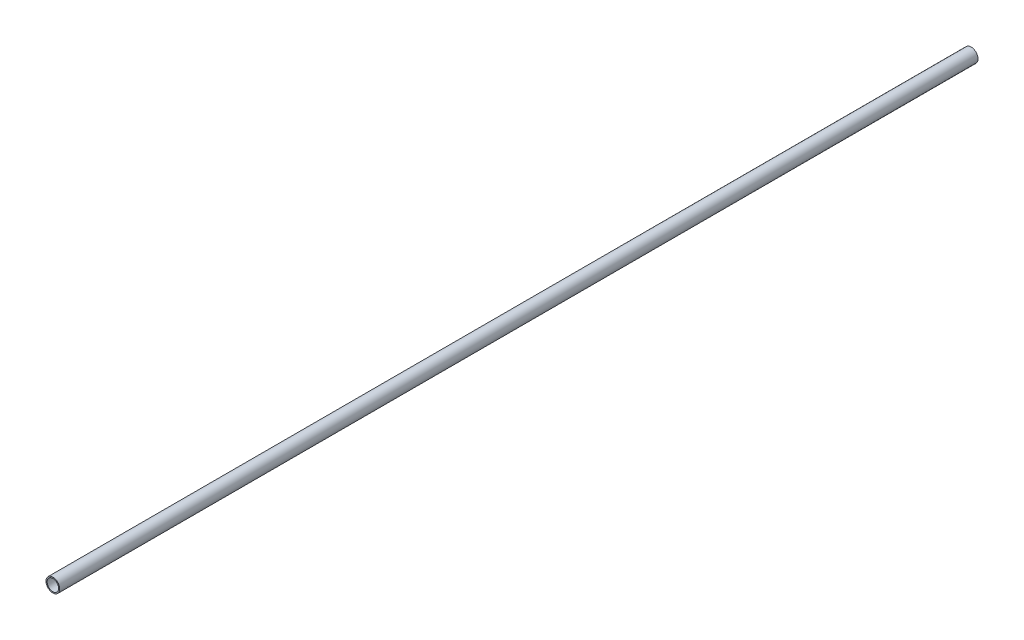
ISO-10303-21;
HEADER;
FILE_DESCRIPTION(('STEP AP214'),'2;1');
FILE_NAME('part.step','',(''),(''),'','','');
FILE_SCHEMA(('AUTOMOTIVE_DESIGN { 1 0 10303 214 1 1 1 1 }'));
ENDSEC;
DATA;
#1=APPLICATION_CONTEXT('core data for automotive mechanical design processes');
#2=APPLICATION_PROTOCOL_DEFINITION('international standard','automotive_design',2000,#1);
#3=PRODUCT_CONTEXT('',#1,'mechanical');
#4=PRODUCT('Part','Part','',(#3));
#5=PRODUCT_RELATED_PRODUCT_CATEGORY('part','',(#4));
#6=PRODUCT_DEFINITION_FORMATION('','',#4);
#7=PRODUCT_DEFINITION_CONTEXT('part definition',#1,'design');
#8=PRODUCT_DEFINITION('design','',#6,#7);
#9=PRODUCT_DEFINITION_SHAPE('','',#8);
#10=(LENGTH_UNIT() NAMED_UNIT(*) SI_UNIT(.MILLI.,.METRE.));
#11=(NAMED_UNIT(*) PLANE_ANGLE_UNIT() SI_UNIT($,.RADIAN.));
#12=(NAMED_UNIT(*) SI_UNIT($,.STERADIAN.) SOLID_ANGLE_UNIT());
#13=UNCERTAINTY_MEASURE_WITH_UNIT(LENGTH_MEASURE(1.E-05),#10,'distance_accuracy_value','');
#14=(GEOMETRIC_REPRESENTATION_CONTEXT(3) GLOBAL_UNCERTAINTY_ASSIGNED_CONTEXT((#13)) GLOBAL_UNIT_ASSIGNED_CONTEXT((#10,
#11,#12)) REPRESENTATION_CONTEXT('',''));
#15=CARTESIAN_POINT('',(0.,0.,0.));
#16=DIRECTION('',(0.,0.,1.));
#17=DIRECTION('',(1.,0.,0.));
#18=AXIS2_PLACEMENT_3D('',#15,#16,#17);
#19=CARTESIAN_POINT('',(0.,0.,800.));
#20=DIRECTION('',(0.,0.,1.));
#21=DIRECTION('',(1.,0.,0.));
#22=AXIS2_PLACEMENT_3D('',#19,#20,#21);
#23=PLANE('',#22);
#24=CARTESIAN_POINT('',(0.,0.,800.));
#25=DIRECTION('',(0.,0.,1.));
#26=DIRECTION('',(1.,0.,0.));
#27=AXIS2_PLACEMENT_3D('',#24,#25,#26);
#28=CIRCLE('',#27,6.);
#29=CARTESIAN_POINT('',(6.,0.,800.));
#30=VERTEX_POINT('',#29);
#31=EDGE_CURVE('E10',#30,#30,#28,.T.);
#32=ORIENTED_EDGE('',*,*,#31,.T.);
#33=EDGE_LOOP('',(#32));
#34=FACE_BOUND('',#33,.T.);
#35=CARTESIAN_POINT('',(0.,0.,800.));
#36=DIRECTION('',(0.,0.,1.));
#37=DIRECTION('',(1.,0.,0.));
#38=AXIS2_PLACEMENT_3D('',#35,#36,#37);
#39=CIRCLE('',#38,5.);
#40=CARTESIAN_POINT('',(5.,0.,800.));
#41=VERTEX_POINT('',#40);
#42=EDGE_CURVE('E41',#41,#41,#39,.T.);
#43=ORIENTED_EDGE('',*,*,#42,.F.);
#44=EDGE_LOOP('',(#43));
#45=FACE_BOUND('',#44,.T.);
#46=ADVANCED_FACE('F30',(#34,#45),#23,.T.);
#47=CARTESIAN_POINT('',(0.,0.,0.));
#48=DIRECTION('',(0.,0.,1.));
#49=DIRECTION('',(1.,0.,0.));
#50=AXIS2_PLACEMENT_3D('',#47,#48,#49);
#51=PLANE('',#50);
#52=CARTESIAN_POINT('',(0.,0.,0.));
#53=DIRECTION('',(0.,0.,1.));
#54=DIRECTION('',(1.,0.,0.));
#55=AXIS2_PLACEMENT_3D('',#52,#53,#54);
#56=CIRCLE('',#55,6.);
#57=CARTESIAN_POINT('',(6.,0.,0.));
#58=VERTEX_POINT('',#57);
#59=EDGE_CURVE('E34',#58,#58,#56,.T.);
#60=ORIENTED_EDGE('',*,*,#59,.F.);
#61=EDGE_LOOP('',(#60));
#62=FACE_BOUND('',#61,.T.);
#63=CARTESIAN_POINT('',(0.,0.,0.));
#64=DIRECTION('',(0.,0.,1.));
#65=DIRECTION('',(1.,0.,0.));
#66=AXIS2_PLACEMENT_3D('',#63,#64,#65);
#67=CIRCLE('',#66,5.);
#68=CARTESIAN_POINT('',(5.,0.,0.));
#69=VERTEX_POINT('',#68);
#70=EDGE_CURVE('E43',#69,#69,#67,.T.);
#71=ORIENTED_EDGE('',*,*,#70,.T.);
#72=EDGE_LOOP('',(#71));
#73=FACE_BOUND('',#72,.T.);
#74=ADVANCED_FACE('F53',(#62,#73),#51,.F.);
#75=CARTESIAN_POINT('',(0.,0.,800.));
#76=DIRECTION('',(0.,0.,-1.));
#77=DIRECTION('',(-1.,0.,0.));
#78=AXIS2_PLACEMENT_3D('',#75,#76,#77);
#79=CYLINDRICAL_SURFACE('',#78,6.);
#80=ORIENTED_EDGE('',*,*,#31,.F.);
#81=EDGE_LOOP('',(#80));
#82=FACE_BOUND('',#81,.T.);
#83=ORIENTED_EDGE('',*,*,#59,.T.);
#84=EDGE_LOOP('',(#83));
#85=FACE_BOUND('',#84,.T.);
#86=ADVANCED_FACE('F32',(#82,#85),#79,.T.);
#87=CARTESIAN_POINT('',(0.,0.,800.));
#88=DIRECTION('',(0.,0.,-1.));
#89=DIRECTION('',(-1.,0.,0.));
#90=AXIS2_PLACEMENT_3D('',#87,#88,#89);
#91=CYLINDRICAL_SURFACE('',#90,5.);
#92=ORIENTED_EDGE('',*,*,#42,.T.);
#93=EDGE_LOOP('',(#92));
#94=FACE_BOUND('',#93,.T.);
#95=ORIENTED_EDGE('',*,*,#70,.F.);
#96=EDGE_LOOP('',(#95));
#97=FACE_BOUND('',#96,.T.);
#98=ADVANCED_FACE('F49',(#94,#97),#91,.F.);
#99=CLOSED_SHELL('',(#46,#74,#86,#98));
#100=MANIFOLD_SOLID_BREP('B2',#99);
#101=ADVANCED_BREP_SHAPE_REPRESENTATION('',(#18,#100),#14);
#102=SHAPE_DEFINITION_REPRESENTATION(#9,#101);
ENDSEC;
END-ISO-10303-21;
